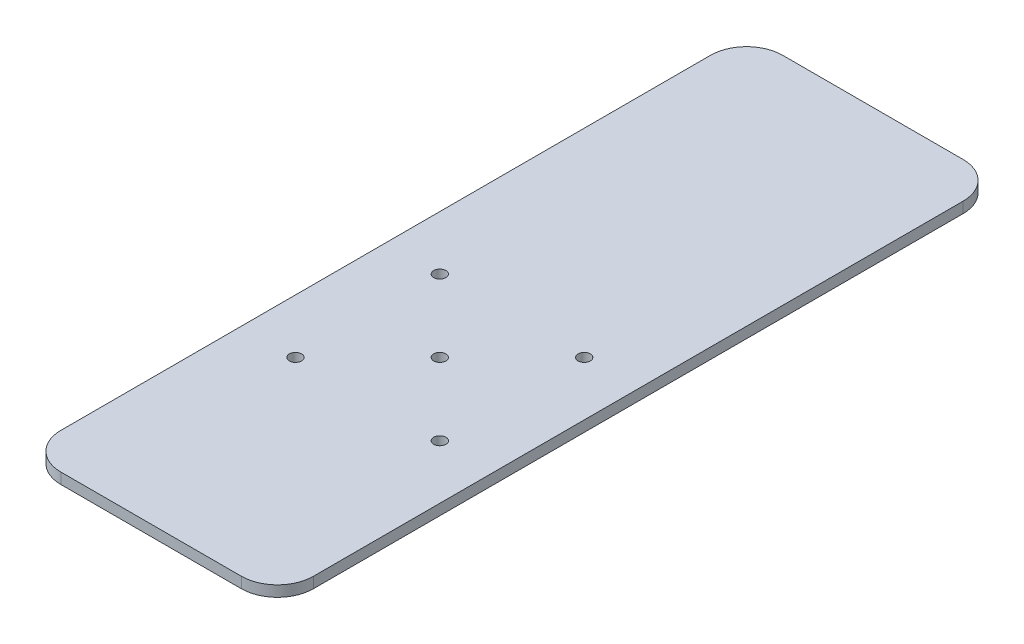
ISO-10303-21;
HEADER;
FILE_DESCRIPTION(('STEP AP214'),'2;1');
FILE_NAME('part.step','',(''),(''),'','','');
FILE_SCHEMA(('AUTOMOTIVE_DESIGN { 1 0 10303 214 1 1 1 1 }'));
ENDSEC;
DATA;
#1=APPLICATION_CONTEXT('core data for automotive mechanical design processes');
#2=APPLICATION_PROTOCOL_DEFINITION('international standard','automotive_design',2000,#1);
#3=PRODUCT_CONTEXT('',#1,'mechanical');
#4=PRODUCT('Part','Part','',(#3));
#5=PRODUCT_RELATED_PRODUCT_CATEGORY('part','',(#4));
#6=PRODUCT_DEFINITION_FORMATION('','',#4);
#7=PRODUCT_DEFINITION_CONTEXT('part definition',#1,'design');
#8=PRODUCT_DEFINITION('design','',#6,#7);
#9=PRODUCT_DEFINITION_SHAPE('','',#8);
#10=(LENGTH_UNIT() NAMED_UNIT(*) SI_UNIT(.MILLI.,.METRE.));
#11=(NAMED_UNIT(*) PLANE_ANGLE_UNIT() SI_UNIT($,.RADIAN.));
#12=(NAMED_UNIT(*) SI_UNIT($,.STERADIAN.) SOLID_ANGLE_UNIT());
#13=UNCERTAINTY_MEASURE_WITH_UNIT(LENGTH_MEASURE(1.E-05),#10,'distance_accuracy_value','');
#14=(GEOMETRIC_REPRESENTATION_CONTEXT(3) GLOBAL_UNCERTAINTY_ASSIGNED_CONTEXT((#13)) GLOBAL_UNIT_ASSIGNED_CONTEXT((#10,
#11,#12)) REPRESENTATION_CONTEXT('',''));
#15=CARTESIAN_POINT('',(0.,0.,0.));
#16=DIRECTION('',(0.,0.,1.));
#17=DIRECTION('',(1.,0.,0.));
#18=AXIS2_PLACEMENT_3D('',#15,#16,#17);
#19=CARTESIAN_POINT('',(-25.,0.,90.));
#20=DIRECTION('',(0.,-1.,0.));
#21=DIRECTION('',(0.,0.,-1.));
#22=AXIS2_PLACEMENT_3D('',#19,#20,#21);
#23=PLANE('',#22);
#24=CARTESIAN_POINT('',(-20.,0.,0.));
#25=DIRECTION('',(0.,1.,0.));
#26=DIRECTION('',(0.,0.,1.));
#27=AXIS2_PLACEMENT_3D('',#24,#25,#26);
#28=CIRCLE('',#27,1.7);
#29=CARTESIAN_POINT('',(-20.,0.,1.7));
#30=VERTEX_POINT('',#29);
#31=EDGE_CURVE('E202',#30,#30,#28,.T.);
#32=ORIENTED_EDGE('',*,*,#31,.T.);
#33=EDGE_LOOP('',(#32));
#34=FACE_BOUND('',#33,.T.);
#35=CARTESIAN_POINT('',(-20.,0.,40.));
#36=DIRECTION('',(0.,1.,0.));
#37=DIRECTION('',(0.,0.,1.));
#38=AXIS2_PLACEMENT_3D('',#35,#36,#37);
#39=CIRCLE('',#38,1.7);
#40=CARTESIAN_POINT('',(-20.,0.,41.7));
#41=VERTEX_POINT('',#40);
#42=EDGE_CURVE('E196',#41,#41,#39,.T.);
#43=ORIENTED_EDGE('',*,*,#42,.T.);
#44=EDGE_LOOP('',(#43));
#45=FACE_BOUND('',#44,.T.);
#46=CARTESIAN_POINT('',(20.,0.,40.));
#47=DIRECTION('',(0.,1.,0.));
#48=DIRECTION('',(0.,0.,1.));
#49=AXIS2_PLACEMENT_3D('',#46,#47,#48);
#50=CIRCLE('',#49,1.7);
#51=CARTESIAN_POINT('',(20.,0.,41.7));
#52=VERTEX_POINT('',#51);
#53=EDGE_CURVE('E190',#52,#52,#50,.T.);
#54=ORIENTED_EDGE('',*,*,#53,.T.);
#55=EDGE_LOOP('',(#54));
#56=FACE_BOUND('',#55,.T.);
#57=CARTESIAN_POINT('',(20.,0.,0.));
#58=DIRECTION('',(0.,1.,0.));
#59=DIRECTION('',(0.,0.,1.));
#60=AXIS2_PLACEMENT_3D('',#57,#58,#59);
#61=CIRCLE('',#60,1.7);
#62=CARTESIAN_POINT('',(20.,0.,1.7));
#63=VERTEX_POINT('',#62);
#64=EDGE_CURVE('E184',#63,#63,#61,.T.);
#65=ORIENTED_EDGE('',*,*,#64,.T.);
#66=EDGE_LOOP('',(#65));
#67=FACE_BOUND('',#66,.T.);
#68=CARTESIAN_POINT('',(-25.,0.,90.));
#69=DIRECTION('',(0.,1.,0.));
#70=DIRECTION('',(0.,0.,-1.));
#71=AXIS2_PLACEMENT_3D('',#68,#69,#70);
#72=CIRCLE('',#71,10.);
#73=CARTESIAN_POINT('',(-35.,0.,89.9999999999999));
#74=VERTEX_POINT('',#73);
#75=CARTESIAN_POINT('',(-24.9999999999999,0.,100.));
#76=VERTEX_POINT('',#75);
#77=EDGE_CURVE('E131',#74,#76,#72,.T.);
#78=ORIENTED_EDGE('',*,*,#77,.F.);
#79=DIRECTION('',(0.,0.,1.));
#80=VECTOR('',#79,1.);
#81=CARTESIAN_POINT('',(-35.,0.,89.9999999999999));
#82=LINE('',#81,#80);
#83=CARTESIAN_POINT('',(-35.,0.,-89.9999999999999));
#84=VERTEX_POINT('',#83);
#85=EDGE_CURVE('E86',#84,#74,#82,.T.);
#86=ORIENTED_EDGE('',*,*,#85,.F.);
#87=CARTESIAN_POINT('',(-25.,0.,-90.));
#88=DIRECTION('',(0.,1.,0.));
#89=DIRECTION('',(0.,0.,-1.));
#90=AXIS2_PLACEMENT_3D('',#87,#88,#89);
#91=CIRCLE('',#90,10.);
#92=CARTESIAN_POINT('',(-24.9999999999999,0.,-100.));
#93=VERTEX_POINT('',#92);
#94=EDGE_CURVE('E80',#93,#84,#91,.T.);
#95=ORIENTED_EDGE('',*,*,#94,.F.);
#96=DIRECTION('',(-1.,0.,0.));
#97=VECTOR('',#96,1.);
#98=CARTESIAN_POINT('',(-24.9999999999999,0.,-100.));
#99=LINE('',#98,#97);
#100=CARTESIAN_POINT('',(24.9999999999999,0.,-100.));
#101=VERTEX_POINT('',#100);
#102=EDGE_CURVE('E121',#101,#93,#99,.T.);
#103=ORIENTED_EDGE('',*,*,#102,.F.);
#104=CARTESIAN_POINT('',(25.,0.,-90.));
#105=DIRECTION('',(0.,1.,0.));
#106=DIRECTION('',(0.,0.,-1.));
#107=AXIS2_PLACEMENT_3D('',#104,#105,#106);
#108=CIRCLE('',#107,10.);
#109=CARTESIAN_POINT('',(35.,0.,-89.9999999999999));
#110=VERTEX_POINT('',#109);
#111=EDGE_CURVE('E141',#110,#101,#108,.T.);
#112=ORIENTED_EDGE('',*,*,#111,.F.);
#113=DIRECTION('',(0.,0.,-1.));
#114=VECTOR('',#113,1.);
#115=CARTESIAN_POINT('',(35.,0.,89.9999999999999));
#116=LINE('',#115,#114);
#117=CARTESIAN_POINT('',(35.,0.,89.9999999999999));
#118=VERTEX_POINT('',#117);
#119=EDGE_CURVE('E139',#118,#110,#116,.T.);
#120=ORIENTED_EDGE('',*,*,#119,.F.);
#121=CARTESIAN_POINT('',(25.,0.,90.));
#122=DIRECTION('',(0.,1.,0.));
#123=DIRECTION('',(0.,0.,1.));
#124=AXIS2_PLACEMENT_3D('',#121,#122,#123);
#125=CIRCLE('',#124,10.);
#126=CARTESIAN_POINT('',(24.9999999999999,0.,100.));
#127=VERTEX_POINT('',#126);
#128=EDGE_CURVE('E137',#127,#118,#125,.T.);
#129=ORIENTED_EDGE('',*,*,#128,.F.);
#130=DIRECTION('',(1.,0.,0.));
#131=VECTOR('',#130,1.);
#132=CARTESIAN_POINT('',(-24.9999999999999,0.,100.));
#133=LINE('',#132,#131);
#134=EDGE_CURVE('E134',#76,#127,#133,.T.);
#135=ORIENTED_EDGE('',*,*,#134,.F.);
#136=EDGE_LOOP('',(#78,#86,#95,#103,#112,#120,#129,#135));
#137=FACE_BOUND('',#136,.T.);
#138=CARTESIAN_POINT('',(0.,0.,20.));
#139=DIRECTION('',(0.,1.,0.));
#140=DIRECTION('',(0.,0.,1.));
#141=AXIS2_PLACEMENT_3D('',#138,#139,#140);
#142=CIRCLE('',#141,1.7);
#143=CARTESIAN_POINT('',(0.,0.,21.7));
#144=VERTEX_POINT('',#143);
#145=EDGE_CURVE('E135',#144,#144,#142,.T.);
#146=ORIENTED_EDGE('',*,*,#145,.T.);
#147=EDGE_LOOP('',(#146));
#148=FACE_BOUND('',#147,.T.);
#149=ADVANCED_FACE('F34',(#34,#45,#56,#67,#137,#148),#23,.T.);
#150=CARTESIAN_POINT('',(-25.,3.,90.));
#151=DIRECTION('',(0.,-1.,0.));
#152=DIRECTION('',(0.,0.,-1.));
#153=AXIS2_PLACEMENT_3D('',#150,#151,#152);
#154=CYLINDRICAL_SURFACE('',#153,10.);
#155=ORIENTED_EDGE('',*,*,#77,.T.);
#156=DIRECTION('',(0.,-1.,0.));
#157=VECTOR('',#156,1.);
#158=CARTESIAN_POINT('',(-24.9999999999999,3.,100.));
#159=LINE('',#158,#157);
#160=CARTESIAN_POINT('',(-24.9999999999999,3.,100.));
#161=VERTEX_POINT('',#160);
#162=EDGE_CURVE('E11',#161,#76,#159,.T.);
#163=ORIENTED_EDGE('',*,*,#162,.F.);
#164=CARTESIAN_POINT('',(-25.,3.,90.));
#165=DIRECTION('',(0.,1.,0.));
#166=DIRECTION('',(0.,0.,-1.));
#167=AXIS2_PLACEMENT_3D('',#164,#165,#166);
#168=CIRCLE('',#167,10.);
#169=CARTESIAN_POINT('',(-35.,3.,89.9999999999999));
#170=VERTEX_POINT('',#169);
#171=EDGE_CURVE('E146',#170,#161,#168,.T.);
#172=ORIENTED_EDGE('',*,*,#171,.F.);
#173=DIRECTION('',(0.,-1.,0.));
#174=VECTOR('',#173,1.);
#175=CARTESIAN_POINT('',(-35.,3.,89.9999999999999));
#176=LINE('',#175,#174);
#177=EDGE_CURVE('E127',#170,#74,#176,.T.);
#178=ORIENTED_EDGE('',*,*,#177,.T.);
#179=EDGE_LOOP('',(#155,#163,#172,#178));
#180=FACE_BOUND('',#179,.T.);
#181=ADVANCED_FACE('F36',(#180),#154,.T.);
#182=CARTESIAN_POINT('',(-24.9999999999999,3.,100.));
#183=DIRECTION('',(0.,0.,-1.));
#184=DIRECTION('',(-1.,0.,0.));
#185=AXIS2_PLACEMENT_3D('',#182,#183,#184);
#186=PLANE('',#185);
#187=ORIENTED_EDGE('',*,*,#134,.T.);
#188=DIRECTION('',(0.,-1.,0.));
#189=VECTOR('',#188,1.);
#190=CARTESIAN_POINT('',(24.9999999999999,3.,100.));
#191=LINE('',#190,#189);
#192=CARTESIAN_POINT('',(24.9999999999999,3.,100.));
#193=VERTEX_POINT('',#192);
#194=EDGE_CURVE('E43',#193,#127,#191,.T.);
#195=ORIENTED_EDGE('',*,*,#194,.F.);
#196=DIRECTION('',(1.,0.,0.));
#197=VECTOR('',#196,1.);
#198=CARTESIAN_POINT('',(-24.9999999999999,3.,100.));
#199=LINE('',#198,#197);
#200=EDGE_CURVE('E94',#161,#193,#199,.T.);
#201=ORIENTED_EDGE('',*,*,#200,.F.);
#202=ORIENTED_EDGE('',*,*,#162,.T.);
#203=EDGE_LOOP('',(#187,#195,#201,#202));
#204=FACE_BOUND('',#203,.T.);
#205=ADVANCED_FACE('F241',(#204),#186,.F.);
#206=CARTESIAN_POINT('',(25.,3.,90.));
#207=DIRECTION('',(0.,-1.,0.));
#208=DIRECTION('',(0.,0.,-1.));
#209=AXIS2_PLACEMENT_3D('',#206,#207,#208);
#210=CYLINDRICAL_SURFACE('',#209,10.);
#211=ORIENTED_EDGE('',*,*,#128,.T.);
#212=DIRECTION('',(0.,-1.,0.));
#213=VECTOR('',#212,1.);
#214=CARTESIAN_POINT('',(35.,3.,89.9999999999999));
#215=LINE('',#214,#213);
#216=CARTESIAN_POINT('',(35.,3.,89.9999999999999));
#217=VERTEX_POINT('',#216);
#218=EDGE_CURVE('E153',#217,#118,#215,.T.);
#219=ORIENTED_EDGE('',*,*,#218,.F.);
#220=CARTESIAN_POINT('',(25.,3.,90.));
#221=DIRECTION('',(0.,1.,0.));
#222=DIRECTION('',(0.,0.,1.));
#223=AXIS2_PLACEMENT_3D('',#220,#221,#222);
#224=CIRCLE('',#223,10.);
#225=EDGE_CURVE('E161',#193,#217,#224,.T.);
#226=ORIENTED_EDGE('',*,*,#225,.F.);
#227=ORIENTED_EDGE('',*,*,#194,.T.);
#228=EDGE_LOOP('',(#211,#219,#226,#227));
#229=FACE_BOUND('',#228,.T.);
#230=ADVANCED_FACE('F159',(#229),#210,.T.);
#231=CARTESIAN_POINT('',(35.,3.,89.9999999999999));
#232=DIRECTION('',(-1.,0.,0.));
#233=DIRECTION('',(0.,0.,1.));
#234=AXIS2_PLACEMENT_3D('',#231,#232,#233);
#235=PLANE('',#234);
#236=ORIENTED_EDGE('',*,*,#119,.T.);
#237=DIRECTION('',(0.,-1.,0.));
#238=VECTOR('',#237,1.);
#239=CARTESIAN_POINT('',(35.,3.,-89.9999999999999));
#240=LINE('',#239,#238);
#241=CARTESIAN_POINT('',(35.,3.,-89.9999999999999));
#242=VERTEX_POINT('',#241);
#243=EDGE_CURVE('E150',#242,#110,#240,.T.);
#244=ORIENTED_EDGE('',*,*,#243,.F.);
#245=DIRECTION('',(0.,0.,-1.));
#246=VECTOR('',#245,1.);
#247=CARTESIAN_POINT('',(35.,3.,89.9999999999999));
#248=LINE('',#247,#246);
#249=EDGE_CURVE('E173',#217,#242,#248,.T.);
#250=ORIENTED_EDGE('',*,*,#249,.F.);
#251=ORIENTED_EDGE('',*,*,#218,.T.);
#252=EDGE_LOOP('',(#236,#244,#250,#251));
#253=FACE_BOUND('',#252,.T.);
#254=ADVANCED_FACE('F169',(#253),#235,.F.);
#255=CARTESIAN_POINT('',(25.,3.,-90.));
#256=DIRECTION('',(0.,-1.,0.));
#257=DIRECTION('',(0.,0.,-1.));
#258=AXIS2_PLACEMENT_3D('',#255,#256,#257);
#259=CYLINDRICAL_SURFACE('',#258,10.);
#260=ORIENTED_EDGE('',*,*,#111,.T.);
#261=DIRECTION('',(0.,-1.,0.));
#262=VECTOR('',#261,1.);
#263=CARTESIAN_POINT('',(24.9999999999999,3.,-100.));
#264=LINE('',#263,#262);
#265=CARTESIAN_POINT('',(24.9999999999999,3.,-100.));
#266=VERTEX_POINT('',#265);
#267=EDGE_CURVE('E122',#266,#101,#264,.T.);
#268=ORIENTED_EDGE('',*,*,#267,.F.);
#269=CARTESIAN_POINT('',(25.,3.,-90.));
#270=DIRECTION('',(0.,1.,0.));
#271=DIRECTION('',(0.,0.,-1.));
#272=AXIS2_PLACEMENT_3D('',#269,#270,#271);
#273=CIRCLE('',#272,10.);
#274=EDGE_CURVE('E113',#242,#266,#273,.T.);
#275=ORIENTED_EDGE('',*,*,#274,.F.);
#276=ORIENTED_EDGE('',*,*,#243,.T.);
#277=EDGE_LOOP('',(#260,#268,#275,#276));
#278=FACE_BOUND('',#277,.T.);
#279=ADVANCED_FACE('F172',(#278),#259,.T.);
#280=CARTESIAN_POINT('',(-24.9999999999999,3.,-100.));
#281=DIRECTION('',(0.,0.,1.));
#282=DIRECTION('',(1.,0.,0.));
#283=AXIS2_PLACEMENT_3D('',#280,#281,#282);
#284=PLANE('',#283);
#285=ORIENTED_EDGE('',*,*,#102,.T.);
#286=DIRECTION('',(0.,-1.,0.));
#287=VECTOR('',#286,1.);
#288=CARTESIAN_POINT('',(-24.9999999999999,3.,-100.));
#289=LINE('',#288,#287);
#290=CARTESIAN_POINT('',(-24.9999999999999,3.,-100.));
#291=VERTEX_POINT('',#290);
#292=EDGE_CURVE('E118',#291,#93,#289,.T.);
#293=ORIENTED_EDGE('',*,*,#292,.F.);
#294=DIRECTION('',(-1.,0.,0.));
#295=VECTOR('',#294,1.);
#296=CARTESIAN_POINT('',(-24.9999999999999,3.,-100.));
#297=LINE('',#296,#295);
#298=EDGE_CURVE('E107',#266,#291,#297,.T.);
#299=ORIENTED_EDGE('',*,*,#298,.F.);
#300=ORIENTED_EDGE('',*,*,#267,.T.);
#301=EDGE_LOOP('',(#285,#293,#299,#300));
#302=FACE_BOUND('',#301,.T.);
#303=ADVANCED_FACE('F119',(#302),#284,.F.);
#304=CARTESIAN_POINT('',(-25.,3.,-90.));
#305=DIRECTION('',(0.,-1.,0.));
#306=DIRECTION('',(0.,0.,-1.));
#307=AXIS2_PLACEMENT_3D('',#304,#305,#306);
#308=CYLINDRICAL_SURFACE('',#307,10.);
#309=ORIENTED_EDGE('',*,*,#94,.T.);
#310=DIRECTION('',(0.,-1.,0.));
#311=VECTOR('',#310,1.);
#312=CARTESIAN_POINT('',(-35.,3.,-89.9999999999999));
#313=LINE('',#312,#311);
#314=CARTESIAN_POINT('',(-35.,3.,-89.9999999999999));
#315=VERTEX_POINT('',#314);
#316=EDGE_CURVE('E123',#315,#84,#313,.T.);
#317=ORIENTED_EDGE('',*,*,#316,.F.);
#318=CARTESIAN_POINT('',(-25.,3.,-90.));
#319=DIRECTION('',(0.,1.,0.));
#320=DIRECTION('',(0.,0.,-1.));
#321=AXIS2_PLACEMENT_3D('',#318,#319,#320);
#322=CIRCLE('',#321,10.);
#323=EDGE_CURVE('E111',#291,#315,#322,.T.);
#324=ORIENTED_EDGE('',*,*,#323,.F.);
#325=ORIENTED_EDGE('',*,*,#292,.T.);
#326=EDGE_LOOP('',(#309,#317,#324,#325));
#327=FACE_BOUND('',#326,.T.);
#328=ADVANCED_FACE('F125',(#327),#308,.T.);
#329=CARTESIAN_POINT('',(-35.,3.,89.9999999999999));
#330=DIRECTION('',(1.,0.,0.));
#331=DIRECTION('',(0.,0.,-1.));
#332=AXIS2_PLACEMENT_3D('',#329,#330,#331);
#333=PLANE('',#332);
#334=ORIENTED_EDGE('',*,*,#85,.T.);
#335=ORIENTED_EDGE('',*,*,#177,.F.);
#336=DIRECTION('',(0.,0.,1.));
#337=VECTOR('',#336,1.);
#338=CARTESIAN_POINT('',(-35.,3.,89.9999999999999));
#339=LINE('',#338,#337);
#340=EDGE_CURVE('E51',#315,#170,#339,.T.);
#341=ORIENTED_EDGE('',*,*,#340,.F.);
#342=ORIENTED_EDGE('',*,*,#316,.T.);
#343=EDGE_LOOP('',(#334,#335,#341,#342));
#344=FACE_BOUND('',#343,.T.);
#345=ADVANCED_FACE('F214',(#344),#333,.F.);
#346=CARTESIAN_POINT('',(-25.,3.,90.));
#347=DIRECTION('',(0.,-1.,0.));
#348=DIRECTION('',(0.,0.,-1.));
#349=AXIS2_PLACEMENT_3D('',#346,#347,#348);
#350=PLANE('',#349);
#351=CARTESIAN_POINT('',(-20.,3.,0.));
#352=DIRECTION('',(0.,1.,0.));
#353=DIRECTION('',(0.,0.,1.));
#354=AXIS2_PLACEMENT_3D('',#351,#352,#353);
#355=CIRCLE('',#354,1.69999999999999);
#356=CARTESIAN_POINT('',(-20.,3.,1.69999999999999));
#357=VERTEX_POINT('',#356);
#358=EDGE_CURVE('E205',#357,#357,#355,.T.);
#359=ORIENTED_EDGE('',*,*,#358,.F.);
#360=EDGE_LOOP('',(#359));
#361=FACE_BOUND('',#360,.T.);
#362=CARTESIAN_POINT('',(-20.,3.,40.));
#363=DIRECTION('',(0.,1.,0.));
#364=DIRECTION('',(0.,0.,1.));
#365=AXIS2_PLACEMENT_3D('',#362,#363,#364);
#366=CIRCLE('',#365,1.69999999999999);
#367=CARTESIAN_POINT('',(-20.,3.,41.7));
#368=VERTEX_POINT('',#367);
#369=EDGE_CURVE('E199',#368,#368,#366,.T.);
#370=ORIENTED_EDGE('',*,*,#369,.F.);
#371=EDGE_LOOP('',(#370));
#372=FACE_BOUND('',#371,.T.);
#373=CARTESIAN_POINT('',(20.,3.,40.));
#374=DIRECTION('',(0.,1.,0.));
#375=DIRECTION('',(0.,0.,1.));
#376=AXIS2_PLACEMENT_3D('',#373,#374,#375);
#377=CIRCLE('',#376,1.69999999999999);
#378=CARTESIAN_POINT('',(20.,3.,41.7));
#379=VERTEX_POINT('',#378);
#380=EDGE_CURVE('E193',#379,#379,#377,.T.);
#381=ORIENTED_EDGE('',*,*,#380,.F.);
#382=EDGE_LOOP('',(#381));
#383=FACE_BOUND('',#382,.T.);
#384=CARTESIAN_POINT('',(20.,3.,0.));
#385=DIRECTION('',(0.,1.,0.));
#386=DIRECTION('',(0.,0.,1.));
#387=AXIS2_PLACEMENT_3D('',#384,#385,#386);
#388=CIRCLE('',#387,1.69999999999999);
#389=CARTESIAN_POINT('',(20.,3.,1.69999999999999));
#390=VERTEX_POINT('',#389);
#391=EDGE_CURVE('E187',#390,#390,#388,.T.);
#392=ORIENTED_EDGE('',*,*,#391,.F.);
#393=EDGE_LOOP('',(#392));
#394=FACE_BOUND('',#393,.T.);
#395=CARTESIAN_POINT('',(0.,3.,20.));
#396=DIRECTION('',(0.,1.,0.));
#397=DIRECTION('',(0.,0.,1.));
#398=AXIS2_PLACEMENT_3D('',#395,#396,#397);
#399=CIRCLE('',#398,1.69999999999999);
#400=CARTESIAN_POINT('',(0.,3.,21.7));
#401=VERTEX_POINT('',#400);
#402=EDGE_CURVE('E181',#401,#401,#399,.T.);
#403=ORIENTED_EDGE('',*,*,#402,.F.);
#404=EDGE_LOOP('',(#403));
#405=FACE_BOUND('',#404,.T.);
#406=ORIENTED_EDGE('',*,*,#171,.T.);
#407=ORIENTED_EDGE('',*,*,#200,.T.);
#408=ORIENTED_EDGE('',*,*,#225,.T.);
#409=ORIENTED_EDGE('',*,*,#249,.T.);
#410=ORIENTED_EDGE('',*,*,#274,.T.);
#411=ORIENTED_EDGE('',*,*,#298,.T.);
#412=ORIENTED_EDGE('',*,*,#323,.T.);
#413=ORIENTED_EDGE('',*,*,#340,.T.);
#414=EDGE_LOOP('',(#406,#407,#408,#409,#410,#411,#412,#413));
#415=FACE_BOUND('',#414,.T.);
#416=ADVANCED_FACE('F109',(#361,#372,#383,#394,#405,#415),#350,.F.);
#417=CARTESIAN_POINT('',(0.,3.,20.));
#418=DIRECTION('',(0.,1.,0.));
#419=DIRECTION('',(0.,0.,1.));
#420=AXIS2_PLACEMENT_3D('',#417,#418,#419);
#421=CYLINDRICAL_SURFACE('',#420,1.69999999999999);
#422=ORIENTED_EDGE('',*,*,#145,.F.);
#423=EDGE_LOOP('',(#422));
#424=FACE_BOUND('',#423,.T.);
#425=ORIENTED_EDGE('',*,*,#402,.T.);
#426=EDGE_LOOP('',(#425));
#427=FACE_BOUND('',#426,.T.);
#428=ADVANCED_FACE('F213',(#424,#427),#421,.F.);
#429=CARTESIAN_POINT('',(20.,3.,0.));
#430=DIRECTION('',(0.,1.,0.));
#431=DIRECTION('',(0.,0.,1.));
#432=AXIS2_PLACEMENT_3D('',#429,#430,#431);
#433=CYLINDRICAL_SURFACE('',#432,1.69999999999999);
#434=ORIENTED_EDGE('',*,*,#64,.F.);
#435=EDGE_LOOP('',(#434));
#436=FACE_BOUND('',#435,.T.);
#437=ORIENTED_EDGE('',*,*,#391,.T.);
#438=EDGE_LOOP('',(#437));
#439=FACE_BOUND('',#438,.T.);
#440=ADVANCED_FACE('F225',(#436,#439),#433,.F.);
#441=CARTESIAN_POINT('',(20.,3.,40.));
#442=DIRECTION('',(0.,1.,0.));
#443=DIRECTION('',(0.,0.,1.));
#444=AXIS2_PLACEMENT_3D('',#441,#442,#443);
#445=CYLINDRICAL_SURFACE('',#444,1.69999999999999);
#446=ORIENTED_EDGE('',*,*,#53,.F.);
#447=EDGE_LOOP('',(#446));
#448=FACE_BOUND('',#447,.T.);
#449=ORIENTED_EDGE('',*,*,#380,.T.);
#450=EDGE_LOOP('',(#449));
#451=FACE_BOUND('',#450,.T.);
#452=ADVANCED_FACE('F231',(#448,#451),#445,.F.);
#453=CARTESIAN_POINT('',(-20.,3.,40.));
#454=DIRECTION('',(0.,1.,0.));
#455=DIRECTION('',(0.,0.,1.));
#456=AXIS2_PLACEMENT_3D('',#453,#454,#455);
#457=CYLINDRICAL_SURFACE('',#456,1.69999999999999);
#458=ORIENTED_EDGE('',*,*,#42,.F.);
#459=EDGE_LOOP('',(#458));
#460=FACE_BOUND('',#459,.T.);
#461=ORIENTED_EDGE('',*,*,#369,.T.);
#462=EDGE_LOOP('',(#461));
#463=FACE_BOUND('',#462,.T.);
#464=ADVANCED_FACE('F312',(#460,#463),#457,.F.);
#465=CARTESIAN_POINT('',(-20.,3.,0.));
#466=DIRECTION('',(0.,1.,0.));
#467=DIRECTION('',(0.,0.,1.));
#468=AXIS2_PLACEMENT_3D('',#465,#466,#467);
#469=CYLINDRICAL_SURFACE('',#468,1.69999999999999);
#470=ORIENTED_EDGE('',*,*,#31,.F.);
#471=EDGE_LOOP('',(#470));
#472=FACE_BOUND('',#471,.T.);
#473=ORIENTED_EDGE('',*,*,#358,.T.);
#474=EDGE_LOOP('',(#473));
#475=FACE_BOUND('',#474,.T.);
#476=ADVANCED_FACE('F209',(#472,#475),#469,.F.);
#477=CLOSED_SHELL('',(#149,#181,#205,#230,#254,#279,#303,#328,#345,#416,#428,#440,#452,#464,#476));
#478=MANIFOLD_SOLID_BREP('B2',#477);
#479=ADVANCED_BREP_SHAPE_REPRESENTATION('',(#18,#478),#14);
#480=SHAPE_DEFINITION_REPRESENTATION(#9,#479);
ENDSEC;
END-ISO-10303-21;
